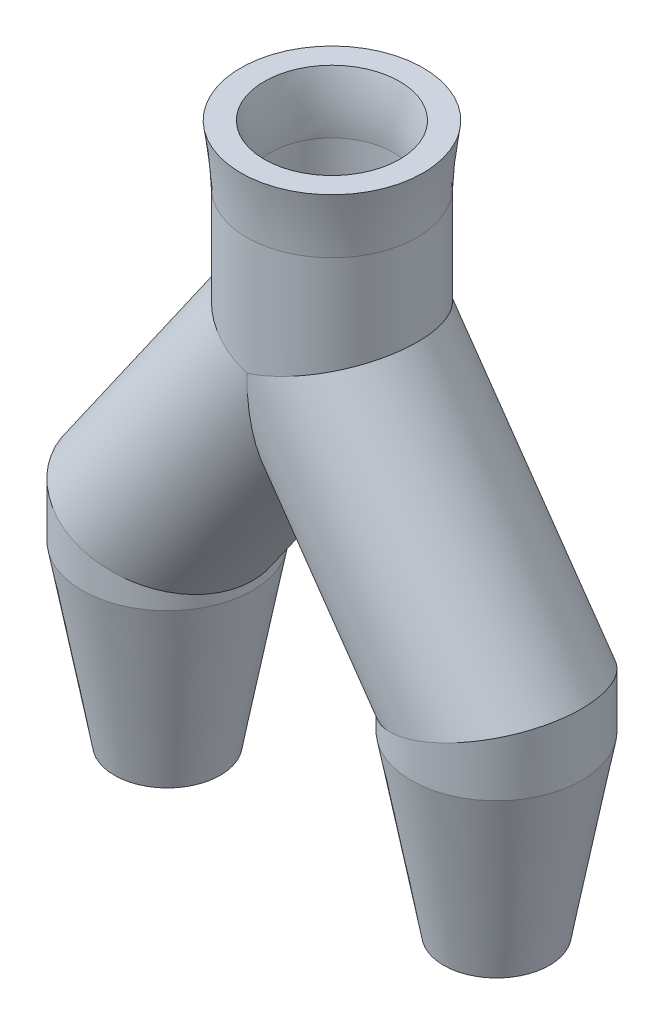
ISO-10303-21;
HEADER;
FILE_DESCRIPTION(('STEP AP214'),'2;1');
FILE_NAME('part.step','',(''),(''),'','','');
FILE_SCHEMA(('AUTOMOTIVE_DESIGN { 1 0 10303 214 1 1 1 1 }'));
ENDSEC;
DATA;
#1=APPLICATION_CONTEXT('core data for automotive mechanical design processes');
#2=APPLICATION_PROTOCOL_DEFINITION('international standard','automotive_design',2000,#1);
#3=PRODUCT_CONTEXT('',#1,'mechanical');
#4=PRODUCT('Part','Part','',(#3));
#5=PRODUCT_RELATED_PRODUCT_CATEGORY('part','',(#4));
#6=PRODUCT_DEFINITION_FORMATION('','',#4);
#7=PRODUCT_DEFINITION_CONTEXT('part definition',#1,'design');
#8=PRODUCT_DEFINITION('design','',#6,#7);
#9=PRODUCT_DEFINITION_SHAPE('','',#8);
#10=(LENGTH_UNIT() NAMED_UNIT(*) SI_UNIT(.MILLI.,.METRE.));
#11=(NAMED_UNIT(*) PLANE_ANGLE_UNIT() SI_UNIT($,.RADIAN.));
#12=(NAMED_UNIT(*) SI_UNIT($,.STERADIAN.) SOLID_ANGLE_UNIT());
#13=UNCERTAINTY_MEASURE_WITH_UNIT(LENGTH_MEASURE(1.E-05),#10,'distance_accuracy_value','');
#14=(GEOMETRIC_REPRESENTATION_CONTEXT(3) GLOBAL_UNCERTAINTY_ASSIGNED_CONTEXT((#13)) GLOBAL_UNIT_ASSIGNED_CONTEXT((#10,
#11,#12)) REPRESENTATION_CONTEXT('',''));
#15=CARTESIAN_POINT('',(0.,0.,0.));
#16=DIRECTION('',(0.,0.,1.));
#17=DIRECTION('',(1.,0.,0.));
#18=AXIS2_PLACEMENT_3D('',#15,#16,#17);
#19=CARTESIAN_POINT('',(14.,-23.,0.));
#20=DIRECTION('',(0.,1.,0.));
#21=DIRECTION('',(0.,0.,1.));
#22=AXIS2_PLACEMENT_3D('',#19,#20,#21);
#23=CYLINDRICAL_SURFACE('',#22,5.25);
#24=CARTESIAN_POINT('',(14.,-23.,0.));
#25=DIRECTION('',(0.,-1.,0.));
#26=DIRECTION('',(0.,0.,-1.));
#27=AXIS2_PLACEMENT_3D('',#24,#25,#26);
#28=CIRCLE('',#27,5.25);
#29=CARTESIAN_POINT('',(19.1666370588641,-23.,-0.931859164236744));
#30=VERTEX_POINT('',#29);
#31=EDGE_CURVE('E226',#30,#30,#28,.T.);
#32=ORIENTED_EDGE('',*,*,#31,.T.);
#33=EDGE_LOOP('',(#32));
#34=FACE_BOUND('',#33,.T.);
#35=CARTESIAN_POINT('',(14.,-20.,0.));
#36=DIRECTION('',(0.300639384879094,-0.953737888656795,0.));
#37=DIRECTION('',(-0.953737888656795,-0.300639384879094,0.));
#38=AXIS2_PLACEMENT_3D('',#35,#36,#37);
#39=ELLIPSE('',#38,5.50465705770994,5.25);
#40=CARTESIAN_POINT('',(8.75,-21.6549167118003,0.));
#41=VERTEX_POINT('',#40);
#42=EDGE_CURVE('E96',#41,#41,#39,.T.);
#43=ORIENTED_EDGE('',*,*,#42,.F.);
#44=EDGE_LOOP('',(#43));
#45=FACE_BOUND('',#44,.T.);
#46=ADVANCED_FACE('F58',(#34,#45),#23,.F.);
#47=CARTESIAN_POINT('',(14.,-23.,0.));
#48=DIRECTION('',(0.,1.,0.));
#49=DIRECTION('',(0.,0.,1.));
#50=AXIS2_PLACEMENT_3D('',#47,#48,#49);
#51=CYLINDRICAL_SURFACE('',#50,7.25);
#52=CARTESIAN_POINT('',(14.,-23.,0.));
#53=DIRECTION('',(0.,1.,0.));
#54=DIRECTION('',(0.,0.,1.));
#55=AXIS2_PLACEMENT_3D('',#52,#53,#54);
#56=CIRCLE('',#55,7.25);
#57=CARTESIAN_POINT('',(14.,-23.,7.25));
#58=VERTEX_POINT('',#57);
#59=EDGE_CURVE('E68',#58,#58,#56,.F.);
#60=ORIENTED_EDGE('',*,*,#59,.F.);
#61=EDGE_LOOP('',(#60));
#62=FACE_BOUND('',#61,.T.);
#63=CARTESIAN_POINT('',(14.,-20.,0.));
#64=DIRECTION('',(-0.300639384879094,0.953737888656795,0.));
#65=DIRECTION('',(0.953737888656795,0.300639384879094,0.));
#66=AXIS2_PLACEMENT_3D('',#63,#64,#65);
#67=ELLIPSE('',#66,7.60166927017087,7.25);
#68=CARTESIAN_POINT('',(21.25,-17.7146388265615,0.));
#69=VERTEX_POINT('',#68);
#70=EDGE_CURVE('E12',#69,#69,#67,.T.);
#71=ORIENTED_EDGE('',*,*,#70,.F.);
#72=EDGE_LOOP('',(#71));
#73=FACE_BOUND('',#72,.T.);
#74=ADVANCED_FACE('F60',(#62,#73),#51,.T.);
#75=CARTESIAN_POINT('',(14.,-20.,0.));
#76=DIRECTION('',(-0.573462344363328,0.81923192051904,0.));
#77=DIRECTION('',(-0.81923192051904,-0.573462344363328,0.));
#78=AXIS2_PLACEMENT_3D('',#75,#76,#77);
#79=CYLINDRICAL_SURFACE('',#78,5.25);
#80=ORIENTED_EDGE('',*,*,#42,.T.);
#81=EDGE_LOOP('',(#80));
#82=FACE_BOUND('',#81,.T.);
#83=CARTESIAN_POINT('',(0.,0.,0.));
#84=DIRECTION('',(1.,0.,0.));
#85=DIRECTION('',(0.,1.,0.));
#86=AXIS2_PLACEMENT_3D('',#83,#84,#85);
#87=ELLIPSE('',#86,9.15491671180027,5.25);
#88=CARTESIAN_POINT('',(0.,0.,5.25));
#89=VERTEX_POINT('',#88);
#90=CARTESIAN_POINT('',(0.,0.,-5.25));
#91=VERTEX_POINT('',#90);
#92=EDGE_CURVE('E82',#89,#91,#87,.T.);
#93=ORIENTED_EDGE('',*,*,#92,.F.);
#94=CARTESIAN_POINT('',(0.,0.,0.));
#95=DIRECTION('',(-0.300639384879094,0.953737888656795,0.));
#96=DIRECTION('',(-0.953737888656795,-0.300639384879094,0.));
#97=AXIS2_PLACEMENT_3D('',#94,#95,#96);
#98=ELLIPSE('',#97,5.50465705770994,5.25);
#99=EDGE_CURVE('E90',#89,#91,#98,.T.);
#100=ORIENTED_EDGE('',*,*,#99,.T.);
#101=EDGE_LOOP('',(#93,#100));
#102=FACE_BOUND('',#101,.T.);
#103=ADVANCED_FACE('F101',(#82,#102),#79,.F.);
#104=CARTESIAN_POINT('',(14.,-20.,0.));
#105=DIRECTION('',(-0.573462344363328,0.81923192051904,0.));
#106=DIRECTION('',(-0.81923192051904,-0.573462344363328,0.));
#107=AXIS2_PLACEMENT_3D('',#104,#105,#106);
#108=CYLINDRICAL_SURFACE('',#107,7.25);
#109=ORIENTED_EDGE('',*,*,#70,.T.);
#110=EDGE_LOOP('',(#109));
#111=FACE_BOUND('',#110,.T.);
#112=CARTESIAN_POINT('',(0.,0.,0.));
#113=DIRECTION('',(-0.300639384879094,0.953737888656795,0.));
#114=DIRECTION('',(-0.953737888656795,-0.300639384879094,0.));
#115=AXIS2_PLACEMENT_3D('',#112,#113,#114);
#116=ELLIPSE('',#115,7.60166927017087,7.25);
#117=CARTESIAN_POINT('',(0.,0.,7.25));
#118=VERTEX_POINT('',#117);
#119=CARTESIAN_POINT('',(0.,0.,-7.25));
#120=VERTEX_POINT('',#119);
#121=EDGE_CURVE('E75',#118,#120,#116,.T.);
#122=ORIENTED_EDGE('',*,*,#121,.F.);
#123=CARTESIAN_POINT('',(0.,0.,0.));
#124=DIRECTION('',(1.,0.,0.));
#125=DIRECTION('',(0.,1.,0.));
#126=AXIS2_PLACEMENT_3D('',#123,#124,#125);
#127=ELLIPSE('',#126,12.6425040305813,7.25);
#128=EDGE_CURVE('E95',#118,#120,#127,.T.);
#129=ORIENTED_EDGE('',*,*,#128,.T.);
#130=EDGE_LOOP('',(#122,#129));
#131=FACE_BOUND('',#130,.T.);
#132=ADVANCED_FACE('F150',(#111,#131),#108,.T.);
#133=CARTESIAN_POINT('',(0.,0.,0.));
#134=DIRECTION('',(0.,1.,0.));
#135=DIRECTION('',(0.,0.,1.));
#136=AXIS2_PLACEMENT_3D('',#133,#134,#135);
#137=CYLINDRICAL_SURFACE('',#136,5.25);
#138=ORIENTED_EDGE('',*,*,#99,.F.);
#139=CARTESIAN_POINT('',(0.,0.,0.));
#140=DIRECTION('',(0.300639384879094,0.953737888656794,0.));
#141=DIRECTION('',(-0.953737888656794,0.300639384879094,0.));
#142=AXIS2_PLACEMENT_3D('',#139,#140,#141);
#143=ELLIPSE('',#142,5.50465705770994,5.25);
#144=EDGE_CURVE('E93',#91,#89,#143,.T.);
#145=ORIENTED_EDGE('',*,*,#144,.F.);
#146=EDGE_LOOP('',(#138,#145));
#147=FACE_BOUND('',#146,.T.);
#148=CARTESIAN_POINT('',(0.,10.,0.));
#149=DIRECTION('',(0.,1.,0.));
#150=DIRECTION('',(0.,0.,1.));
#151=AXIS2_PLACEMENT_3D('',#148,#149,#150);
#152=CIRCLE('',#151,5.25);
#153=CARTESIAN_POINT('',(-2.73749013940013,10.,4.47980443062943));
#154=VERTEX_POINT('',#153);
#155=EDGE_CURVE('E62',#154,#154,#152,.T.);
#156=ORIENTED_EDGE('',*,*,#155,.T.);
#157=EDGE_LOOP('',(#156));
#158=FACE_BOUND('',#157,.T.);
#159=ADVANCED_FACE('F91',(#147,#158),#137,.F.);
#160=CARTESIAN_POINT('',(0.,0.,0.));
#161=DIRECTION('',(0.,1.,0.));
#162=DIRECTION('',(0.,0.,1.));
#163=AXIS2_PLACEMENT_3D('',#160,#161,#162);
#164=CYLINDRICAL_SURFACE('',#163,7.25);
#165=CARTESIAN_POINT('',(0.,0.,0.));
#166=DIRECTION('',(0.300639384879094,0.953737888656794,0.));
#167=DIRECTION('',(-0.953737888656794,0.300639384879094,0.));
#168=AXIS2_PLACEMENT_3D('',#165,#166,#167);
#169=ELLIPSE('',#168,7.60166927017087,7.25);
#170=EDGE_CURVE('E99',#120,#118,#169,.T.);
#171=ORIENTED_EDGE('',*,*,#170,.T.);
#172=ORIENTED_EDGE('',*,*,#121,.T.);
#173=EDGE_LOOP('',(#171,#172));
#174=FACE_BOUND('',#173,.T.);
#175=CARTESIAN_POINT('',(0.,10.,0.));
#176=DIRECTION('',(0.,1.,0.));
#177=DIRECTION('',(0.,0.,1.));
#178=AXIS2_PLACEMENT_3D('',#175,#176,#177);
#179=CIRCLE('',#178,7.25);
#180=CARTESIAN_POINT('',(-6.04203803526265,10.,4.0070283728019));
#181=VERTEX_POINT('',#180);
#182=EDGE_CURVE('E323',#181,#181,#179,.T.);
#183=ORIENTED_EDGE('',*,*,#182,.F.);
#184=EDGE_LOOP('',(#183));
#185=FACE_BOUND('',#184,.T.);
#186=ADVANCED_FACE('F142',(#174,#185),#164,.T.);
#187=CARTESIAN_POINT('',(-14.,-20.,0.));
#188=DIRECTION('',(0.573462344363328,0.819231920519041,0.));
#189=DIRECTION('',(-0.819231920519041,0.573462344363328,0.));
#190=AXIS2_PLACEMENT_3D('',#187,#188,#189);
#191=CYLINDRICAL_SURFACE('',#190,5.25);
#192=CARTESIAN_POINT('',(-14.,-20.,0.));
#193=DIRECTION('',(0.300639384879094,0.953737888656794,0.));
#194=DIRECTION('',(-0.953737888656794,0.300639384879094,0.));
#195=AXIS2_PLACEMENT_3D('',#192,#193,#194);
#196=ELLIPSE('',#195,5.50465705770994,5.25);
#197=CARTESIAN_POINT('',(-19.25,-18.3450832881997,0.));
#198=VERTEX_POINT('',#197);
#199=EDGE_CURVE('E268',#198,#198,#196,.T.);
#200=ORIENTED_EDGE('',*,*,#199,.F.);
#201=EDGE_LOOP('',(#200));
#202=FACE_BOUND('',#201,.T.);
#203=ORIENTED_EDGE('',*,*,#92,.T.);
#204=ORIENTED_EDGE('',*,*,#144,.T.);
#205=EDGE_LOOP('',(#203,#204));
#206=FACE_BOUND('',#205,.T.);
#207=ADVANCED_FACE('F98',(#202,#206),#191,.F.);
#208=CARTESIAN_POINT('',(-14.,-20.,0.));
#209=DIRECTION('',(0.573462344363328,0.819231920519041,0.));
#210=DIRECTION('',(-0.819231920519041,0.573462344363328,0.));
#211=AXIS2_PLACEMENT_3D('',#208,#209,#210);
#212=CYLINDRICAL_SURFACE('',#211,7.25);
#213=CARTESIAN_POINT('',(-14.,-20.,0.));
#214=DIRECTION('',(-0.300639384879094,-0.953737888656794,0.));
#215=DIRECTION('',(0.953737888656794,-0.300639384879094,0.));
#216=AXIS2_PLACEMENT_3D('',#213,#214,#215);
#217=ELLIPSE('',#216,7.60166927017087,7.25);
#218=CARTESIAN_POINT('',(-6.74999999999999,-22.2853611734385,0.));
#219=VERTEX_POINT('',#218);
#220=EDGE_CURVE('E273',#219,#219,#217,.T.);
#221=ORIENTED_EDGE('',*,*,#220,.F.);
#222=EDGE_LOOP('',(#221));
#223=FACE_BOUND('',#222,.T.);
#224=ORIENTED_EDGE('',*,*,#170,.F.);
#225=ORIENTED_EDGE('',*,*,#128,.F.);
#226=EDGE_LOOP('',(#224,#225));
#227=FACE_BOUND('',#226,.T.);
#228=ADVANCED_FACE('F136',(#223,#227),#212,.T.);
#229=CARTESIAN_POINT('',(-14.,-23.,0.));
#230=DIRECTION('',(0.,1.,0.));
#231=DIRECTION('',(-1.,0.,0.));
#232=AXIS2_PLACEMENT_3D('',#229,#230,#231);
#233=CYLINDRICAL_SURFACE('',#232,5.25);
#234=CARTESIAN_POINT('',(-14.,-23.,0.));
#235=DIRECTION('',(0.,1.,0.));
#236=DIRECTION('',(0.,0.,-1.));
#237=AXIS2_PLACEMENT_3D('',#234,#235,#236);
#238=CIRCLE('',#237,5.25);
#239=CARTESIAN_POINT('',(-19.1666370588641,-23.,-0.931859164236744));
#240=VERTEX_POINT('',#239);
#241=EDGE_CURVE('E163',#240,#240,#238,.T.);
#242=ORIENTED_EDGE('',*,*,#241,.F.);
#243=EDGE_LOOP('',(#242));
#244=FACE_BOUND('',#243,.T.);
#245=ORIENTED_EDGE('',*,*,#199,.T.);
#246=EDGE_LOOP('',(#245));
#247=FACE_BOUND('',#246,.T.);
#248=ADVANCED_FACE('F133',(#244,#247),#233,.F.);
#249=CARTESIAN_POINT('',(-14.,-23.,0.));
#250=DIRECTION('',(0.,1.,0.));
#251=DIRECTION('',(-1.,0.,0.));
#252=AXIS2_PLACEMENT_3D('',#249,#250,#251);
#253=CYLINDRICAL_SURFACE('',#252,7.25);
#254=CARTESIAN_POINT('',(-14.,-23.,0.));
#255=DIRECTION('',(0.,-1.,0.));
#256=DIRECTION('',(0.,0.,-1.));
#257=AXIS2_PLACEMENT_3D('',#254,#255,#256);
#258=CIRCLE('',#257,7.25);
#259=CARTESIAN_POINT('',(-14.,-23.,-7.25));
#260=VERTEX_POINT('',#259);
#261=EDGE_CURVE('E115',#260,#260,#258,.T.);
#262=ORIENTED_EDGE('',*,*,#261,.F.);
#263=EDGE_LOOP('',(#262));
#264=FACE_BOUND('',#263,.T.);
#265=ORIENTED_EDGE('',*,*,#220,.T.);
#266=EDGE_LOOP('',(#265));
#267=FACE_BOUND('',#266,.T.);
#268=ADVANCED_FACE('F122',(#264,#267),#253,.T.);
#269=CARTESIAN_POINT('',(14.,-38.,0.));
#270=DIRECTION('',(0.,1.,0.));
#271=DIRECTION('',(0.,0.,1.));
#272=AXIS2_PLACEMENT_3D('',#269,#270,#271);
#273=PLANE('',#272);
#274=CARTESIAN_POINT('',(14.,-38.,0.));
#275=DIRECTION('',(0.,1.,0.));
#276=DIRECTION('',(0.,0.,1.));
#277=AXIS2_PLACEMENT_3D('',#274,#275,#276);
#278=CIRCLE('',#277,2.5);
#279=CARTESIAN_POINT('',(16.4974149483021,-38.,0.113659913766334));
#280=VERTEX_POINT('',#279);
#281=EDGE_CURVE('E231',#280,#280,#278,.T.);
#282=ORIENTED_EDGE('',*,*,#281,.T.);
#283=EDGE_LOOP('',(#282));
#284=FACE_BOUND('',#283,.T.);
#285=CARTESIAN_POINT('',(14.,-38.,0.));
#286=DIRECTION('',(0.,1.,0.));
#287=DIRECTION('',(0.,0.,1.));
#288=AXIS2_PLACEMENT_3D('',#285,#286,#287);
#289=CIRCLE('',#288,4.5);
#290=CARTESIAN_POINT('',(14.,-38.,4.5));
#291=VERTEX_POINT('',#290);
#292=EDGE_CURVE('E234',#291,#291,#289,.T.);
#293=ORIENTED_EDGE('',*,*,#292,.F.);
#294=EDGE_LOOP('',(#293));
#295=FACE_BOUND('',#294,.T.);
#296=ADVANCED_FACE('F132',(#284,#295),#273,.F.);
#297=CARTESIAN_POINT('',(14.,-38.,0.));
#298=DIRECTION('',(0.,1.,0.));
#299=DIRECTION('',(0.,0.,1.));
#300=AXIS2_PLACEMENT_3D('',#297,#298,#299);
#301=CONICAL_SURFACE('',#300,4.5,0.18131977440149);
#302=ORIENTED_EDGE('',*,*,#59,.T.);
#303=EDGE_LOOP('',(#302));
#304=FACE_BOUND('',#303,.T.);
#305=ORIENTED_EDGE('',*,*,#292,.T.);
#306=EDGE_LOOP('',(#305));
#307=FACE_BOUND('',#306,.T.);
#308=ADVANCED_FACE('F244',(#304,#307),#301,.T.);
#309=CARTESIAN_POINT('',(19.1666370588641,-23.,-0.931859164236744));
#310=CARTESIAN_POINT('',(16.4974149483021,-38.,0.113659913766334));
#311=CARTESIAN_POINT('',(21.0303553873376,-23.,9.40141495349148));
#312=CARTESIAN_POINT('',(16.2700951207694,-38.,5.10848981037047));
#313=CARTESIAN_POINT('',(10.6970812696094,-23.,11.265133281965));
#314=CARTESIAN_POINT('',(11.2752652241653,-38.,4.8811699828378));
#315=CARTESIAN_POINT('',(8.83336294113589,-23.,0.931859164236745));
#316=CARTESIAN_POINT('',(11.5025850516979,-38.,-0.113659913766334));
#317=CARTESIAN_POINT('',(6.9696446126624,-23.,-9.40141495349148));
#318=CARTESIAN_POINT('',(11.7299048792306,-38.,-5.10848981037047));
#319=CARTESIAN_POINT('',(17.3029187303906,-23.,-11.265133281965));
#320=CARTESIAN_POINT('',(16.7247347758347,-38.,-4.8811699828378));
#321=CARTESIAN_POINT('',(19.1666370588641,-23.,-0.931859164236744));
#322=CARTESIAN_POINT('',(16.4974149483021,-38.,0.113659913766334));
#323=(BOUNDED_SURFACE() B_SPLINE_SURFACE(3,1,((#309,#310),(#311,#312),(#313,#314),(#315,#316),
(#317,#318),(#319,#320),(#321,#322)),.UNSPECIFIED.,.T.,.F.,.F.) B_SPLINE_SURFACE_WITH_KNOTS((4,
3,4),(2,2),(0.,0.5,1.),(0.,1.),
.UNSPECIFIED.) GEOMETRIC_REPRESENTATION_ITEM() RATIONAL_B_SPLINE_SURFACE(((1.,1.),
(0.333333333333333,0.333333333333333),(0.333333333333333,0.333333333333333),(1.,1.),
(0.333333333333333,0.333333333333333),(0.333333333333333,0.333333333333333),(1.,1.))) REPRESENTATION_ITEM('') SURFACE());
#324=CARTESIAN_POINT('',(19.1666370588641,-23.,-0.931859164236744));
#325=CARTESIAN_POINT('',(19.1388326618791,-23.15625,-0.920968340507546));
#326=CARTESIAN_POINT('',(19.1110282648941,-23.3125,-0.910077516778347));
#327=CARTESIAN_POINT('',(19.055419470924,-23.625,-0.888295869319949));
#328=CARTESIAN_POINT('',(19.027615073939,-23.78125,-0.87740504559075));
#329=CARTESIAN_POINT('',(18.972006279969,-24.09375,-0.855623398132353));
#330=CARTESIAN_POINT('',(18.9442018829839,-24.25,-0.844732574403154));
#331=CARTESIAN_POINT('',(18.8885930890139,-24.5625,-0.822950926944757));
#332=CARTESIAN_POINT('',(18.8607886920289,-24.71875,-0.812060103215558));
#333=CARTESIAN_POINT('',(18.8051798980588,-25.03125,-0.790278455757161));
#334=CARTESIAN_POINT('',(18.7773755010738,-25.1875,-0.779387632027962));
#335=CARTESIAN_POINT('',(18.7217667071038,-25.5,-0.757605984569565));
#336=CARTESIAN_POINT('',(18.6939623101188,-25.65625,-0.746715160840366));
#337=CARTESIAN_POINT('',(18.6383535161487,-25.96875,-0.724933513381968));
#338=CARTESIAN_POINT('',(18.6105491191637,-26.125,-0.71404268965277));
#339=CARTESIAN_POINT('',(18.5549403251936,-26.4375,-0.692261042194372));
#340=CARTESIAN_POINT('',(18.5271359282086,-26.59375,-0.681370218465173));
#341=CARTESIAN_POINT('',(18.4715271342386,-26.90625,-0.659588571006776));
#342=CARTESIAN_POINT('',(18.4437227372536,-27.0625,-0.648697747277577));
#343=CARTESIAN_POINT('',(18.3881139432835,-27.375,-0.62691609981918));
#344=CARTESIAN_POINT('',(18.3603095462985,-27.53125,-0.616025276089981));
#345=CARTESIAN_POINT('',(18.3047007523285,-27.84375,-0.594243628631584));
#346=CARTESIAN_POINT('',(18.2768963553434,-28.,-0.583352804902385));
#347=CARTESIAN_POINT('',(18.2212875613734,-28.3125,-0.561571157443987));
#348=CARTESIAN_POINT('',(18.1934831643884,-28.46875,-0.550680333714789));
#349=CARTESIAN_POINT('',(18.1378743704183,-28.78125,-0.528898686256391));
#350=CARTESIAN_POINT('',(18.1100699734333,-28.9375,-0.518007862527193));
#351=CARTESIAN_POINT('',(18.0544611794633,-29.25,-0.496226215068795));
#352=CARTESIAN_POINT('',(18.0266567824782,-29.40625,-0.485335391339596));
#353=CARTESIAN_POINT('',(17.9710479885082,-29.71875,-0.463553743881199));
#354=CARTESIAN_POINT('',(17.9432435915232,-29.875,-0.452662920152));
#355=CARTESIAN_POINT('',(17.8876347975531,-30.1875,-0.430881272693603));
#356=CARTESIAN_POINT('',(17.8598304005681,-30.34375,-0.419990448964404));
#357=CARTESIAN_POINT('',(17.8042216065981,-30.65625,-0.398208801506006));
#358=CARTESIAN_POINT('',(17.7764172096131,-30.8125,-0.387317977776808));
#359=CARTESIAN_POINT('',(17.720808415643,-31.125,-0.36553633031841));
#360=CARTESIAN_POINT('',(17.693004018658,-31.28125,-0.354645506589212));
#361=CARTESIAN_POINT('',(17.6373952246879,-31.59375,-0.332863859130814));
#362=CARTESIAN_POINT('',(17.6095908277029,-31.75,-0.321973035401615));
#363=CARTESIAN_POINT('',(17.5539820337329,-32.0625,-0.300191387943218));
#364=CARTESIAN_POINT('',(17.5261776367479,-32.21875,-0.289300564214019));
#365=CARTESIAN_POINT('',(17.4705688427778,-32.53125,-0.267518916755622));
#366=CARTESIAN_POINT('',(17.4427644457928,-32.6875,-0.256628093026423));
#367=CARTESIAN_POINT('',(17.3871556518228,-33.,-0.234846445568026));
#368=CARTESIAN_POINT('',(17.3593512548377,-33.15625,-0.223955621838827));
#369=CARTESIAN_POINT('',(17.3037424608677,-33.46875,-0.202173974380429));
#370=CARTESIAN_POINT('',(17.2759380638827,-33.625,-0.191283150651231));
#371=CARTESIAN_POINT('',(17.2203292699126,-33.9375,-0.169501503192833));
#372=CARTESIAN_POINT('',(17.1925248729276,-34.09375,-0.158610679463635));
#373=CARTESIAN_POINT('',(17.1369160789576,-34.40625,-0.136829032005237));
#374=CARTESIAN_POINT('',(17.1091116819725,-34.5625,-0.125938208276038));
#375=CARTESIAN_POINT('',(17.0535028880025,-34.875,-0.104156560817641));
#376=CARTESIAN_POINT('',(17.0256984910175,-35.03125,-0.093265737088442));
#377=CARTESIAN_POINT('',(16.9700896970474,-35.34375,-0.0714840896300446));
#378=CARTESIAN_POINT('',(16.9422853000624,-35.5,-0.0605932659008459));
#379=CARTESIAN_POINT('',(16.8866765060924,-35.8125,-0.0388116184424485));
#380=CARTESIAN_POINT('',(16.8588721091073,-35.96875,-0.0279207947132499));
#381=CARTESIAN_POINT('',(16.8032633151373,-36.28125,-0.00613914725485239));
#382=CARTESIAN_POINT('',(16.7754589181523,-36.4375,0.00475167647434641));
#383=CARTESIAN_POINT('',(16.7198501241822,-36.75,0.0265333239327439));
#384=CARTESIAN_POINT('',(16.6920457271972,-36.90625,0.0374241476619426));
#385=CARTESIAN_POINT('',(16.6364369332272,-37.21875,0.0592057951203401));
#386=CARTESIAN_POINT('',(16.6086325362422,-37.375,0.0700966188495388));
#387=CARTESIAN_POINT('',(16.5530237422721,-37.6875,0.0918782663079364));
#388=CARTESIAN_POINT('',(16.5252193452871,-37.84375,0.102769090037135));
#389=CARTESIAN_POINT('',(16.4974149483021,-38.,0.113659913766334));
#390=B_SPLINE_CURVE_WITH_KNOTS('',3,(#324,#325,#326,#327,#328,#329,#330,#331,#332,#333,#334,
#335,#336,#337,#338,#339,#340,#341,#342,#343,#344,#345,#346,#347,#348,#349,#350,#351,#352,#353,
#354,#355,#356,#357,#358,#359,#360,#361,#362,#363,#364,#365,#366,#367,#368,#369,#370,#371,#372,
#373,#374,#375,#376,#377,#378,#379,#380,#381,#382,#383,#384,#385,#386,#387,#388,#389),
.UNSPECIFIED.,.F.,.F.,(4,2,2,2,2,2,2,2,2,2,2,2,2,2,2,2,2,2,2,2,2,2,2,2,2,2,2,2,2,2,2,2,4),(0.,
0.477233499765902,0.954466999531799,1.4317004992977,1.9089339990636,2.3861674988295,
2.86340099859541,3.34063449836131,3.81786799812721,4.29510149789311,4.77233499765901,
5.24956849742491,5.72680199719081,6.20403549695671,6.68126899672261,7.15850249648852,
7.63573599625441,8.11296949602032,8.59020299578622,9.06743649555212,9.54466999531802,
10.0219034950839,10.4991369948498,10.9763704946157,11.4536039943816,11.9308374941475,
12.4080709939134,12.8853044936793,13.3625379934452,13.8397714932111,14.317004992977,
14.7942384927429,15.2714719925088),.UNSPECIFIED.);
#391=EDGE_CURVE('BSEAM252',#30,#280,#390,.T.);
#392=ORIENTED_EDGE('',*,*,#31,.F.);
#393=ORIENTED_EDGE('',*,*,#281,.F.);
#394=ORIENTED_EDGE('',*,*,#391,.T.);
#395=ORIENTED_EDGE('',*,*,#391,.F.);
#396=EDGE_LOOP('',(#392,#394,#393,#395));
#397=FACE_BOUND('',#396,.T.);
#398=ADVANCED_FACE('F252',(#397),#323,.F.);
#399=CARTESIAN_POINT('',(-14.,-38.,0.));
#400=DIRECTION('',(0.,1.,0.));
#401=DIRECTION('',(0.,0.,1.));
#402=AXIS2_PLACEMENT_3D('',#399,#400,#401);
#403=PLANE('',#402);
#404=CARTESIAN_POINT('',(-14.,-38.,0.));
#405=DIRECTION('',(0.,-1.,0.));
#406=DIRECTION('',(0.,0.,1.));
#407=AXIS2_PLACEMENT_3D('',#404,#405,#406);
#408=CIRCLE('',#407,2.5);
#409=CARTESIAN_POINT('',(-16.4974149483021,-38.,0.113659913766334));
#410=VERTEX_POINT('',#409);
#411=EDGE_CURVE('E166',#410,#410,#408,.T.);
#412=ORIENTED_EDGE('',*,*,#411,.F.);
#413=EDGE_LOOP('',(#412));
#414=FACE_BOUND('',#413,.T.);
#415=CARTESIAN_POINT('',(-14.,-38.,0.));
#416=DIRECTION('',(0.,-1.,0.));
#417=DIRECTION('',(0.,0.,1.));
#418=AXIS2_PLACEMENT_3D('',#415,#416,#417);
#419=CIRCLE('',#418,4.5);
#420=CARTESIAN_POINT('',(-14.,-38.,4.5));
#421=VERTEX_POINT('',#420);
#422=EDGE_CURVE('E179',#421,#421,#419,.T.);
#423=ORIENTED_EDGE('',*,*,#422,.T.);
#424=EDGE_LOOP('',(#423));
#425=FACE_BOUND('',#424,.T.);
#426=ADVANCED_FACE('F198',(#414,#425),#403,.F.);
#427=CARTESIAN_POINT('',(-14.,-38.,0.));
#428=DIRECTION('',(0.,1.,0.));
#429=DIRECTION('',(0.,0.,1.));
#430=AXIS2_PLACEMENT_3D('',#427,#428,#429);
#431=CONICAL_SURFACE('',#430,4.5,0.18131977440149);
#432=ORIENTED_EDGE('',*,*,#261,.T.);
#433=EDGE_LOOP('',(#432));
#434=FACE_BOUND('',#433,.T.);
#435=ORIENTED_EDGE('',*,*,#422,.F.);
#436=EDGE_LOOP('',(#435));
#437=FACE_BOUND('',#436,.T.);
#438=ADVANCED_FACE('F188',(#434,#437),#431,.T.);
#439=CARTESIAN_POINT('',(-19.1666370588641,-23.,-0.931859164236744));
#440=CARTESIAN_POINT('',(-16.4974149483021,-38.,0.113659913766334));
#441=CARTESIAN_POINT('',(-21.0303553873376,-23.,9.40141495349148));
#442=CARTESIAN_POINT('',(-16.2700951207694,-38.,5.10848981037047));
#443=CARTESIAN_POINT('',(-10.6970812696094,-23.,11.265133281965));
#444=CARTESIAN_POINT('',(-11.2752652241653,-38.,4.8811699828378));
#445=CARTESIAN_POINT('',(-8.83336294113589,-23.,0.931859164236745));
#446=CARTESIAN_POINT('',(-11.5025850516979,-38.,-0.113659913766334));
#447=CARTESIAN_POINT('',(-6.9696446126624,-23.,-9.40141495349148));
#448=CARTESIAN_POINT('',(-11.7299048792306,-38.,-5.10848981037047));
#449=CARTESIAN_POINT('',(-17.3029187303906,-23.,-11.265133281965));
#450=CARTESIAN_POINT('',(-16.7247347758347,-38.,-4.8811699828378));
#451=CARTESIAN_POINT('',(-19.1666370588641,-23.,-0.931859164236744));
#452=CARTESIAN_POINT('',(-16.4974149483021,-38.,0.113659913766334));
#453=(BOUNDED_SURFACE() B_SPLINE_SURFACE(3,1,((#439,#440),(#441,#442),(#443,#444),(#445,#446),
(#447,#448),(#449,#450),(#451,#452)),.UNSPECIFIED.,.T.,.F.,.F.) B_SPLINE_SURFACE_WITH_KNOTS((4,
3,4),(2,2),(0.,0.5,1.),(0.,1.),
.UNSPECIFIED.) GEOMETRIC_REPRESENTATION_ITEM() RATIONAL_B_SPLINE_SURFACE(((1.,1.),
(0.333333333333333,0.333333333333333),(0.333333333333333,0.333333333333333),(1.,1.),
(0.333333333333333,0.333333333333333),(0.333333333333333,0.333333333333333),(1.,1.))) REPRESENTATION_ITEM('') SURFACE());
#454=CARTESIAN_POINT('',(-19.1666370588641,-23.,-0.931859164236744));
#455=CARTESIAN_POINT('',(-19.1388326618791,-23.15625,-0.920968340507546));
#456=CARTESIAN_POINT('',(-19.1110282648941,-23.3125,-0.910077516778347));
#457=CARTESIAN_POINT('',(-19.055419470924,-23.625,-0.888295869319949));
#458=CARTESIAN_POINT('',(-19.027615073939,-23.78125,-0.87740504559075));
#459=CARTESIAN_POINT('',(-18.972006279969,-24.09375,-0.855623398132353));
#460=CARTESIAN_POINT('',(-18.9442018829839,-24.25,-0.844732574403154));
#461=CARTESIAN_POINT('',(-18.8885930890139,-24.5625,-0.822950926944757));
#462=CARTESIAN_POINT('',(-18.8607886920289,-24.71875,-0.812060103215558));
#463=CARTESIAN_POINT('',(-18.8051798980588,-25.03125,-0.790278455757161));
#464=CARTESIAN_POINT('',(-18.7773755010738,-25.1875,-0.779387632027962));
#465=CARTESIAN_POINT('',(-18.7217667071038,-25.5,-0.757605984569565));
#466=CARTESIAN_POINT('',(-18.6939623101188,-25.65625,-0.746715160840366));
#467=CARTESIAN_POINT('',(-18.6383535161487,-25.96875,-0.724933513381968));
#468=CARTESIAN_POINT('',(-18.6105491191637,-26.125,-0.71404268965277));
#469=CARTESIAN_POINT('',(-18.5549403251936,-26.4375,-0.692261042194372));
#470=CARTESIAN_POINT('',(-18.5271359282086,-26.59375,-0.681370218465173));
#471=CARTESIAN_POINT('',(-18.4715271342386,-26.90625,-0.659588571006776));
#472=CARTESIAN_POINT('',(-18.4437227372536,-27.0625,-0.648697747277577));
#473=CARTESIAN_POINT('',(-18.3881139432835,-27.375,-0.62691609981918));
#474=CARTESIAN_POINT('',(-18.3603095462985,-27.53125,-0.616025276089981));
#475=CARTESIAN_POINT('',(-18.3047007523285,-27.84375,-0.594243628631584));
#476=CARTESIAN_POINT('',(-18.2768963553434,-28.,-0.583352804902385));
#477=CARTESIAN_POINT('',(-18.2212875613734,-28.3125,-0.561571157443987));
#478=CARTESIAN_POINT('',(-18.1934831643884,-28.46875,-0.550680333714789));
#479=CARTESIAN_POINT('',(-18.1378743704183,-28.78125,-0.528898686256391));
#480=CARTESIAN_POINT('',(-18.1100699734333,-28.9375,-0.518007862527193));
#481=CARTESIAN_POINT('',(-18.0544611794633,-29.25,-0.496226215068795));
#482=CARTESIAN_POINT('',(-18.0266567824782,-29.40625,-0.485335391339596));
#483=CARTESIAN_POINT('',(-17.9710479885082,-29.71875,-0.463553743881199));
#484=CARTESIAN_POINT('',(-17.9432435915232,-29.875,-0.452662920152));
#485=CARTESIAN_POINT('',(-17.8876347975531,-30.1875,-0.430881272693603));
#486=CARTESIAN_POINT('',(-17.8598304005681,-30.34375,-0.419990448964404));
#487=CARTESIAN_POINT('',(-17.8042216065981,-30.65625,-0.398208801506006));
#488=CARTESIAN_POINT('',(-17.7764172096131,-30.8125,-0.387317977776808));
#489=CARTESIAN_POINT('',(-17.720808415643,-31.125,-0.36553633031841));
#490=CARTESIAN_POINT('',(-17.693004018658,-31.28125,-0.354645506589212));
#491=CARTESIAN_POINT('',(-17.6373952246879,-31.59375,-0.332863859130814));
#492=CARTESIAN_POINT('',(-17.6095908277029,-31.75,-0.321973035401615));
#493=CARTESIAN_POINT('',(-17.5539820337329,-32.0625,-0.300191387943218));
#494=CARTESIAN_POINT('',(-17.5261776367479,-32.21875,-0.289300564214019));
#495=CARTESIAN_POINT('',(-17.4705688427778,-32.53125,-0.267518916755622));
#496=CARTESIAN_POINT('',(-17.4427644457928,-32.6875,-0.256628093026423));
#497=CARTESIAN_POINT('',(-17.3871556518228,-33.,-0.234846445568026));
#498=CARTESIAN_POINT('',(-17.3593512548377,-33.15625,-0.223955621838827));
#499=CARTESIAN_POINT('',(-17.3037424608677,-33.46875,-0.202173974380429));
#500=CARTESIAN_POINT('',(-17.2759380638827,-33.625,-0.191283150651231));
#501=CARTESIAN_POINT('',(-17.2203292699126,-33.9375,-0.169501503192833));
#502=CARTESIAN_POINT('',(-17.1925248729276,-34.09375,-0.158610679463635));
#503=CARTESIAN_POINT('',(-17.1369160789576,-34.40625,-0.136829032005237));
#504=CARTESIAN_POINT('',(-17.1091116819725,-34.5625,-0.125938208276038));
#505=CARTESIAN_POINT('',(-17.0535028880025,-34.875,-0.104156560817641));
#506=CARTESIAN_POINT('',(-17.0256984910175,-35.03125,-0.093265737088442));
#507=CARTESIAN_POINT('',(-16.9700896970474,-35.34375,-0.0714840896300446));
#508=CARTESIAN_POINT('',(-16.9422853000624,-35.5,-0.0605932659008459));
#509=CARTESIAN_POINT('',(-16.8866765060924,-35.8125,-0.0388116184424485));
#510=CARTESIAN_POINT('',(-16.8588721091073,-35.96875,-0.0279207947132499));
#511=CARTESIAN_POINT('',(-16.8032633151373,-36.28125,-0.00613914725485239));
#512=CARTESIAN_POINT('',(-16.7754589181523,-36.4375,0.00475167647434641));
#513=CARTESIAN_POINT('',(-16.7198501241822,-36.75,0.0265333239327439));
#514=CARTESIAN_POINT('',(-16.6920457271972,-36.90625,0.0374241476619426));
#515=CARTESIAN_POINT('',(-16.6364369332272,-37.21875,0.0592057951203401));
#516=CARTESIAN_POINT('',(-16.6086325362422,-37.375,0.0700966188495388));
#517=CARTESIAN_POINT('',(-16.5530237422721,-37.6875,0.0918782663079364));
#518=CARTESIAN_POINT('',(-16.5252193452871,-37.84375,0.102769090037135));
#519=CARTESIAN_POINT('',(-16.4974149483021,-38.,0.113659913766334));
#520=B_SPLINE_CURVE_WITH_KNOTS('',3,(#454,#455,#456,#457,#458,#459,#460,#461,#462,#463,#464,
#465,#466,#467,#468,#469,#470,#471,#472,#473,#474,#475,#476,#477,#478,#479,#480,#481,#482,#483,
#484,#485,#486,#487,#488,#489,#490,#491,#492,#493,#494,#495,#496,#497,#498,#499,#500,#501,#502,
#503,#504,#505,#506,#507,#508,#509,#510,#511,#512,#513,#514,#515,#516,#517,#518,#519),
.UNSPECIFIED.,.F.,.F.,(4,2,2,2,2,2,2,2,2,2,2,2,2,2,2,2,2,2,2,2,2,2,2,2,2,2,2,2,2,2,2,2,4),(0.,
0.477233499765902,0.954466999531799,1.4317004992977,1.9089339990636,2.3861674988295,
2.86340099859541,3.34063449836131,3.81786799812721,4.29510149789311,4.77233499765901,
5.24956849742491,5.72680199719081,6.20403549695671,6.68126899672261,7.15850249648852,
7.63573599625441,8.11296949602032,8.59020299578622,9.06743649555212,9.54466999531802,
10.0219034950839,10.4991369948498,10.9763704946157,11.4536039943816,11.9308374941475,
12.4080709939134,12.8853044936793,13.3625379934452,13.8397714932111,14.317004992977,
14.7942384927429,15.2714719925088),.UNSPECIFIED.);
#521=EDGE_CURVE('BSEAM197',#240,#410,#520,.T.);
#522=ORIENTED_EDGE('',*,*,#241,.T.);
#523=ORIENTED_EDGE('',*,*,#411,.T.);
#524=ORIENTED_EDGE('',*,*,#521,.T.);
#525=ORIENTED_EDGE('',*,*,#521,.F.);
#526=EDGE_LOOP('',(#522,#524,#523,#525));
#527=FACE_BOUND('',#526,.T.);
#528=ADVANCED_FACE('F197',(#527),#453,.T.);
#529=CARTESIAN_POINT('',(0.,15.,0.));
#530=DIRECTION('',(0.,1.,0.));
#531=DIRECTION('',(0.,0.,1.));
#532=AXIS2_PLACEMENT_3D('',#529,#530,#531);
#533=PLANE('',#532);
#534=CARTESIAN_POINT('',(0.,15.,0.));
#535=DIRECTION('',(0.,1.,0.));
#536=DIRECTION('',(0.,0.,1.));
#537=AXIS2_PLACEMENT_3D('',#534,#535,#536);
#538=CIRCLE('',#537,5.75);
#539=CARTESIAN_POINT('',(-5.19658605100707,15.,2.46129913145046));
#540=VERTEX_POINT('',#539);
#541=EDGE_CURVE('E362',#540,#540,#538,.T.);
#542=ORIENTED_EDGE('',*,*,#541,.F.);
#543=EDGE_LOOP('',(#542));
#544=FACE_BOUND('',#543,.T.);
#545=CARTESIAN_POINT('',(0.,15.,0.));
#546=DIRECTION('',(0.,1.,0.));
#547=DIRECTION('',(0.,0.,1.));
#548=AXIS2_PLACEMENT_3D('',#545,#546,#547);
#549=CIRCLE('',#548,7.75);
#550=CARTESIAN_POINT('',(-7.37966409433592,15.,2.36707791480746));
#551=VERTEX_POINT('',#550);
#552=EDGE_CURVE('E167',#551,#551,#549,.T.);
#553=ORIENTED_EDGE('',*,*,#552,.T.);
#554=EDGE_LOOP('',(#553));
#555=FACE_BOUND('',#554,.T.);
#556=ADVANCED_FACE('F310',(#544,#555),#533,.T.);
#557=CARTESIAN_POINT('',(-6.04203803526265,10.,4.0070283728019));
#558=CARTESIAN_POINT('',(-7.37966409433592,15.,2.36707791480746));
#559=CARTESIAN_POINT('',(1.97201871034115,10.,16.0911044433272));
#560=CARTESIAN_POINT('',(-2.645508264721,15.,17.1264061034793));
#561=CARTESIAN_POINT('',(14.0560947808664,10.,8.07704769772339));
#562=CARTESIAN_POINT('',(12.1138199239509,15.,12.3922502738644));
#563=CARTESIAN_POINT('',(6.04203803526265,10.,-4.0070283728019));
#564=CARTESIAN_POINT('',(7.37966409433592,15.,-2.36707791480747));
#565=CARTESIAN_POINT('',(-1.97201871034115,10.,-16.0911044433272));
#566=CARTESIAN_POINT('',(2.64550826472099,15.,-17.1264061034793));
#567=CARTESIAN_POINT('',(-14.0560947808664,10.,-8.0770476977234));
#568=CARTESIAN_POINT('',(-12.1138199239509,15.,-12.3922502738644));
#569=CARTESIAN_POINT('',(-6.04203803526265,10.,4.0070283728019));
#570=CARTESIAN_POINT('',(-7.37966409433592,15.,2.36707791480746));
#571=(BOUNDED_SURFACE() B_SPLINE_SURFACE(3,1,((#557,#558),(#559,#560),(#561,#562),(#563,#564),
(#565,#566),(#567,#568),(#569,#570)),.UNSPECIFIED.,.T.,.F.,.F.) B_SPLINE_SURFACE_WITH_KNOTS((4,
3,4),(2,2),(0.,0.5,1.),(0.,1.),
.UNSPECIFIED.) GEOMETRIC_REPRESENTATION_ITEM() RATIONAL_B_SPLINE_SURFACE(((1.,1.),
(0.333333333333334,0.333333333333333),(0.333333333333334,0.333333333333333),(1.,1.),
(0.333333333333333,0.333333333333333),(0.333333333333333,0.333333333333333),(1.,1.))) REPRESENTATION_ITEM('') SURFACE());
#572=CARTESIAN_POINT('',(-6.04203803526265,10.,4.0070283728019));
#573=CARTESIAN_POINT('',(-6.05597164004466,10.0520833333333,3.98994555553113));
#574=CARTESIAN_POINT('',(-6.06990524482667,10.1041666666667,3.97286273826035));
#575=CARTESIAN_POINT('',(-6.0977724543907,10.2083333333333,3.9386971037188));
#576=CARTESIAN_POINT('',(-6.11170605917272,10.2604166666667,3.92161428644803));
#577=CARTESIAN_POINT('',(-6.13957326873674,10.3645833333333,3.88744865190648));
#578=CARTESIAN_POINT('',(-6.15350687351876,10.4166666666667,3.8703658346357));
#579=CARTESIAN_POINT('',(-6.18137408308278,10.5208333333333,3.83620020009415));
#580=CARTESIAN_POINT('',(-6.1953076878648,10.5729166666667,3.81911738282338));
#581=CARTESIAN_POINT('',(-6.22317489742882,10.6770833333333,3.78495174828182));
#582=CARTESIAN_POINT('',(-6.23710850221084,10.7291666666667,3.76786893101105));
#583=CARTESIAN_POINT('',(-6.26497571177486,10.8333333333333,3.7337032964695));
#584=CARTESIAN_POINT('',(-6.27890931655687,10.8854166666667,3.71662047919872));
#585=CARTESIAN_POINT('',(-6.3067765261209,10.9895833333333,3.68245484465717));
#586=CARTESIAN_POINT('',(-6.32071013090291,11.0416666666667,3.6653720273864));
#587=CARTESIAN_POINT('',(-6.34857734046694,11.1458333333333,3.63120639284484));
#588=CARTESIAN_POINT('',(-6.36251094524895,11.1979166666667,3.61412357557407));
#589=CARTESIAN_POINT('',(-6.39037815481298,11.3020833333333,3.57995794103252));
#590=CARTESIAN_POINT('',(-6.40431175959499,11.3541666666667,3.56287512376174));
#591=CARTESIAN_POINT('',(-6.43217896915902,11.4583333333333,3.52870948922019));
#592=CARTESIAN_POINT('',(-6.44611257394103,11.5104166666667,3.51162667194942));
#593=CARTESIAN_POINT('',(-6.47397978350506,11.6145833333333,3.47746103740787));
#594=CARTESIAN_POINT('',(-6.48791338828707,11.6666666666667,3.46037822013709));
#595=CARTESIAN_POINT('',(-6.5157805978511,11.7708333333333,3.42621258559554));
#596=CARTESIAN_POINT('',(-6.52971420263311,11.8229166666667,3.40912976832476));
#597=CARTESIAN_POINT('',(-6.55758141219714,11.9270833333333,3.37496413378321));
#598=CARTESIAN_POINT('',(-6.57151501697915,11.9791666666667,3.35788131651244));
#599=CARTESIAN_POINT('',(-6.59938222654318,12.0833333333333,3.32371568197089));
#600=CARTESIAN_POINT('',(-6.61331583132519,12.1354166666667,3.30663286470011));
#601=CARTESIAN_POINT('',(-6.64118304088922,12.2395833333333,3.27246723015856));
#602=CARTESIAN_POINT('',(-6.65511664567123,12.2916666666667,3.25538441288778));
#603=CARTESIAN_POINT('',(-6.68298385523526,12.3958333333333,3.22121877834623));
#604=CARTESIAN_POINT('',(-6.69691746001727,12.4479166666667,3.20413596107546));
#605=CARTESIAN_POINT('',(-6.7247846695813,12.5520833333333,3.16997032653391));
#606=CARTESIAN_POINT('',(-6.73871827436331,12.6041666666667,3.15288750926313));
#607=CARTESIAN_POINT('',(-6.76658548392734,12.7083333333333,3.11872187472158));
#608=CARTESIAN_POINT('',(-6.78051908870935,12.7604166666667,3.10163905745081));
#609=CARTESIAN_POINT('',(-6.80838629827338,12.8645833333333,3.06747342290925));
#610=CARTESIAN_POINT('',(-6.82231990305539,12.9166666666667,3.05039060563848));
#611=CARTESIAN_POINT('',(-6.85018711261942,13.0208333333333,3.01622497109693));
#612=CARTESIAN_POINT('',(-6.86412071740143,13.0729166666667,2.99914215382615));
#613=CARTESIAN_POINT('',(-6.89198792696546,13.1770833333333,2.9649765192846));
#614=CARTESIAN_POINT('',(-6.90592153174747,13.2291666666667,2.94789370201383));
#615=CARTESIAN_POINT('',(-6.9337887413115,13.3333333333333,2.91372806747227));
#616=CARTESIAN_POINT('',(-6.94772234609351,13.3854166666667,2.8966452502015));
#617=CARTESIAN_POINT('',(-6.97558955565754,13.4895833333333,2.86247961565995));
#618=CARTESIAN_POINT('',(-6.98952316043955,13.5416666666667,2.84539679838917));
#619=CARTESIAN_POINT('',(-7.01739037000358,13.6458333333333,2.81123116384762));
#620=CARTESIAN_POINT('',(-7.03132397478559,13.6979166666667,2.79414834657685));
#621=CARTESIAN_POINT('',(-7.05919118434962,13.8020833333333,2.7599827120353));
#622=CARTESIAN_POINT('',(-7.07312478913163,13.8541666666667,2.74289989476452));
#623=CARTESIAN_POINT('',(-7.10099199869566,13.9583333333333,2.70873426022297));
#624=CARTESIAN_POINT('',(-7.11492560347767,14.0104166666667,2.69165144295219));
#625=CARTESIAN_POINT('',(-7.1427928130417,14.1145833333333,2.65748580841064));
#626=CARTESIAN_POINT('',(-7.15672641782371,14.1666666666667,2.64040299113987));
#627=CARTESIAN_POINT('',(-7.18459362738774,14.2708333333333,2.60623735659832));
#628=CARTESIAN_POINT('',(-7.19852723216975,14.3229166666667,2.58915453932754));
#629=CARTESIAN_POINT('',(-7.22639444173378,14.4270833333333,2.55498890478599));
#630=CARTESIAN_POINT('',(-7.24032804651579,14.4791666666667,2.53790608751521));
#631=CARTESIAN_POINT('',(-7.26819525607982,14.5833333333333,2.50374045297366));
#632=CARTESIAN_POINT('',(-7.28212886086183,14.6354166666667,2.48665763570289));
#633=CARTESIAN_POINT('',(-7.30999607042586,14.7395833333333,2.45249200116134));
#634=CARTESIAN_POINT('',(-7.32392967520787,14.7916666666667,2.43540918389056));
#635=CARTESIAN_POINT('',(-7.3517968847719,14.8958333333333,2.40124354934901));
#636=CARTESIAN_POINT('',(-7.36573048955391,14.9479166666667,2.38416073207824));
#637=CARTESIAN_POINT('',(-7.37966409433592,15.,2.36707791480746));
#638=B_SPLINE_CURVE_WITH_KNOTS('',3,(#572,#573,#574,#575,#576,#577,#578,#579,#580,#581,#582,
#583,#584,#585,#586,#587,#588,#589,#590,#591,#592,#593,#594,#595,#596,#597,#598,#599,#600,#601,
#602,#603,#604,#605,#606,#607,#608,#609,#610,#611,#612,#613,#614,#615,#616,#617,#618,#619,#620,
#621,#622,#623,#624,#625,#626,#627,#628,#629,#630,#631,#632,#633,#634,#635,#636,#637),
.UNSPECIFIED.,.F.,.F.,(4,2,2,2,2,2,2,2,2,2,2,2,2,2,2,2,2,2,2,2,2,2,2,2,2,2,2,2,2,2,2,2,4),(0.,
0.169669603621723,0.339339207243444,0.509008810865166,0.67867841448689,0.848348018108613,
1.01801762173033,1.18768722535206,1.35735682897378,1.5270264325955,1.69669603621722,
1.86636563983895,2.03603524346067,2.20570484708239,2.37537445070412,2.54504405432584,
2.71471365794756,2.88438326156928,3.05405286519101,3.22372246881273,3.39339207243445,
3.56306167605617,3.73273127967789,3.90240088329962,4.07207048692134,4.24174009054306,
4.41140969416479,4.58107929778651,4.75074890140823,4.92041850502995,5.09008810865167,
5.2597577122734,5.42942731589512),.UNSPECIFIED.);
#639=EDGE_CURVE('BSEAM315',#181,#551,#638,.T.);
#640=ORIENTED_EDGE('',*,*,#182,.T.);
#641=ORIENTED_EDGE('',*,*,#552,.F.);
#642=ORIENTED_EDGE('',*,*,#639,.T.);
#643=ORIENTED_EDGE('',*,*,#639,.F.);
#644=EDGE_LOOP('',(#640,#642,#641,#643));
#645=FACE_BOUND('',#644,.T.);
#646=ADVANCED_FACE('F315',(#645),#571,.T.);
#647=CARTESIAN_POINT('',(-2.73749013940013,10.,4.47980443062943));
#648=CARTESIAN_POINT('',(-5.19658605100707,15.,2.46129913145046));
#649=CARTESIAN_POINT('',(6.22211872185872,10.,9.95478470942969));
#650=CARTESIAN_POINT('',(-0.273987788106141,15.,12.8544712334646));
#651=CARTESIAN_POINT('',(11.697099000659,10.,0.995175848170833));
#652=CARTESIAN_POINT('',(10.119184313908,15.,7.93187297056367));
#653=CARTESIAN_POINT('',(2.73749013940013,10.,-4.47980443062943));
#654=CARTESIAN_POINT('',(5.19658605100707,15.,-2.46129913145046));
#655=CARTESIAN_POINT('',(-6.22211872185872,10.,-9.95478470942969));
#656=CARTESIAN_POINT('',(0.273987788106139,15.,-12.8544712334646));
#657=CARTESIAN_POINT('',(-11.697099000659,10.,-0.995175848170834));
#658=CARTESIAN_POINT('',(-10.119184313908,15.,-7.93187297056367));
#659=CARTESIAN_POINT('',(-2.73749013940013,10.,4.47980443062943));
#660=CARTESIAN_POINT('',(-5.19658605100707,15.,2.46129913145046));
#661=(BOUNDED_SURFACE() B_SPLINE_SURFACE(3,1,((#647,#648),(#649,#650),(#651,#652),(#653,#654),
(#655,#656),(#657,#658),(#659,#660)),.UNSPECIFIED.,.T.,.F.,.F.) B_SPLINE_SURFACE_WITH_KNOTS((4,
3,4),(2,2),(0.,0.5,1.),(0.,1.),
.UNSPECIFIED.) GEOMETRIC_REPRESENTATION_ITEM() RATIONAL_B_SPLINE_SURFACE(((1.,1.),
(0.333333333333333,0.333333333333333),(0.333333333333333,0.333333333333333),(1.,1.),
(0.333333333333333,0.333333333333333),(0.333333333333333,0.333333333333333),(1.,1.))) REPRESENTATION_ITEM('') SURFACE());
#662=CARTESIAN_POINT('',(-2.73749013940013,10.,4.47980443062943));
#663=CARTESIAN_POINT('',(-2.7631057218127,10.0520833333333,4.45877833376298));
#664=CARTESIAN_POINT('',(-2.78872130422528,10.1041666666667,4.43775223689653));
#665=CARTESIAN_POINT('',(-2.83995246905042,10.2083333333333,4.39570004316364));
#666=CARTESIAN_POINT('',(-2.86556805146299,10.2604166666667,4.37467394629719));
#667=CARTESIAN_POINT('',(-2.91679921628814,10.3645833333333,4.3326217525643));
#668=CARTESIAN_POINT('',(-2.94241479870071,10.4166666666667,4.31159565569785));
#669=CARTESIAN_POINT('',(-2.99364596352585,10.5208333333333,4.26954346196495));
#670=CARTESIAN_POINT('',(-3.01926154593843,10.5729166666667,4.24851736509851));
#671=CARTESIAN_POINT('',(-3.07049271076357,10.6770833333333,4.20646517136561));
#672=CARTESIAN_POINT('',(-3.09610829317614,10.7291666666667,4.18543907449916));
#673=CARTESIAN_POINT('',(-3.14733945800129,10.8333333333333,4.14338688076627));
#674=CARTESIAN_POINT('',(-3.17295504041386,10.8854166666667,4.12236078389982));
#675=CARTESIAN_POINT('',(-3.224186205239,10.9895833333333,4.08030859016693));
#676=CARTESIAN_POINT('',(-3.24980178765158,11.0416666666667,4.05928249330048));
#677=CARTESIAN_POINT('',(-3.30103295247672,11.1458333333333,4.01723029956758));
#678=CARTESIAN_POINT('',(-3.32664853488929,11.1979166666667,3.99620420270114));
#679=CARTESIAN_POINT('',(-3.37787969971444,11.3020833333333,3.95415200896824));
#680=CARTESIAN_POINT('',(-3.40349528212701,11.3541666666667,3.93312591210179));
#681=CARTESIAN_POINT('',(-3.45472644695215,11.4583333333333,3.8910737183689));
#682=CARTESIAN_POINT('',(-3.48034202936473,11.5104166666667,3.87004762150245));
#683=CARTESIAN_POINT('',(-3.53157319418987,11.6145833333333,3.82799542776955));
#684=CARTESIAN_POINT('',(-3.55718877660244,11.6666666666667,3.80696933090311));
#685=CARTESIAN_POINT('',(-3.60841994142759,11.7708333333333,3.76491713717021));
#686=CARTESIAN_POINT('',(-3.63403552384016,11.8229166666667,3.74389104030376));
#687=CARTESIAN_POINT('',(-3.68526668866531,11.9270833333333,3.70183884657087));
#688=CARTESIAN_POINT('',(-3.71088227107788,11.9791666666667,3.68081274970442));
#689=CARTESIAN_POINT('',(-3.76211343590302,12.0833333333333,3.63876055597153));
#690=CARTESIAN_POINT('',(-3.78772901831559,12.1354166666667,3.61773445910508));
#691=CARTESIAN_POINT('',(-3.83896018314074,12.2395833333333,3.57568226537218));
#692=CARTESIAN_POINT('',(-3.86457576555331,12.2916666666667,3.55465616850574));
#693=CARTESIAN_POINT('',(-3.91580693037845,12.3958333333333,3.51260397477284));
#694=CARTESIAN_POINT('',(-3.94142251279103,12.4479166666667,3.49157787790639));
#695=CARTESIAN_POINT('',(-3.99265367761617,12.5520833333333,3.4495256841735));
#696=CARTESIAN_POINT('',(-4.01826926002874,12.6041666666667,3.42849958730705));
#697=CARTESIAN_POINT('',(-4.06950042485389,12.7083333333333,3.38644739357416));
#698=CARTESIAN_POINT('',(-4.09511600726646,12.7604166666667,3.36542129670771));
#699=CARTESIAN_POINT('',(-4.14634717209161,12.8645833333333,3.32336910297481));
#700=CARTESIAN_POINT('',(-4.17196275450418,12.9166666666667,3.30234300610837));
#701=CARTESIAN_POINT('',(-4.22319391932932,13.0208333333333,3.26029081237547));
#702=CARTESIAN_POINT('',(-4.24880950174189,13.0729166666667,3.23926471550902));
#703=CARTESIAN_POINT('',(-4.30004066656704,13.1770833333333,3.19721252177613));
#704=CARTESIAN_POINT('',(-4.32565624897961,13.2291666666667,3.17618642490968));
#705=CARTESIAN_POINT('',(-4.37688741380476,13.3333333333333,3.13413423117679));
#706=CARTESIAN_POINT('',(-4.40250299621733,13.3854166666667,3.11310813431034));
#707=CARTESIAN_POINT('',(-4.45373416104247,13.4895833333333,3.07105594057744));
#708=CARTESIAN_POINT('',(-4.47934974345505,13.5416666666667,3.050029843711));
#709=CARTESIAN_POINT('',(-4.53058090828019,13.6458333333333,3.0079776499781));
#710=CARTESIAN_POINT('',(-4.55619649069276,13.6979166666667,2.98695155311165));
#711=CARTESIAN_POINT('',(-4.60742765551791,13.8020833333333,2.94489935937876));
#712=CARTESIAN_POINT('',(-4.63304323793048,13.8541666666667,2.92387326251231));
#713=CARTESIAN_POINT('',(-4.68427440275562,13.9583333333333,2.88182106877942));
#714=CARTESIAN_POINT('',(-4.70988998516819,14.0104166666667,2.86079497191297));
#715=CARTESIAN_POINT('',(-4.76112114999334,14.1145833333333,2.81874277818007));
#716=CARTESIAN_POINT('',(-4.78673673240591,14.1666666666667,2.79771668131362));
#717=CARTESIAN_POINT('',(-4.83796789723106,14.2708333333333,2.75566448758073));
#718=CARTESIAN_POINT('',(-4.86358347964363,14.3229166666667,2.73463839071428));
#719=CARTESIAN_POINT('',(-4.91481464446877,14.4270833333333,2.69258619698139));
#720=CARTESIAN_POINT('',(-4.94043022688134,14.4791666666667,2.67156010011494));
#721=CARTESIAN_POINT('',(-4.99166139170649,14.5833333333333,2.62950790638204));
#722=CARTESIAN_POINT('',(-5.01727697411906,14.6354166666667,2.6084818095156));
#723=CARTESIAN_POINT('',(-5.06850813894421,14.7395833333333,2.5664296157827));
#724=CARTESIAN_POINT('',(-5.09412372135678,14.7916666666667,2.54540351891625));
#725=CARTESIAN_POINT('',(-5.14535488618192,14.8958333333333,2.50335132518336));
#726=CARTESIAN_POINT('',(-5.1709704685945,14.9479166666667,2.48232522831691));
#727=CARTESIAN_POINT('',(-5.19658605100707,15.,2.46129913145046));
#728=B_SPLINE_CURVE_WITH_KNOTS('',3,(#662,#663,#664,#665,#666,#667,#668,#669,#670,#671,#672,
#673,#674,#675,#676,#677,#678,#679,#680,#681,#682,#683,#684,#685,#686,#687,#688,#689,#690,#691,
#692,#693,#694,#695,#696,#697,#698,#699,#700,#701,#702,#703,#704,#705,#706,#707,#708,#709,#710,
#711,#712,#713,#714,#715,#716,#717,#718,#719,#720,#721,#722,#723,#724,#725,#726,#727),
.UNSPECIFIED.,.F.,.F.,(4,2,2,2,2,2,2,2,2,2,2,2,2,2,2,2,2,2,2,2,2,2,2,2,2,2,2,2,2,2,2,2,4),(0.,
0.185198152814634,0.370396305629267,0.555594458443902,0.740792611258538,0.925990764073172,
1.11118891688781,1.29638706970244,1.48158522251707,1.66678337533171,1.85198152814634,
2.03717968096098,2.22237783377561,2.40757598659025,2.59277413940488,2.77797229221952,
2.96317044503415,3.14836859784878,3.33356675066342,3.51876490347805,3.70396305629269,
3.88916120910732,4.07435936192195,4.25955751473659,4.44475566755122,4.62995382036586,
4.81515197318049,5.00035012599513,5.18554827880976,5.3707464316244,5.55594458443903,
5.74114273725366,5.9263408900683),.UNSPECIFIED.);
#729=EDGE_CURVE('BSEAM340',#154,#540,#728,.T.);
#730=ORIENTED_EDGE('',*,*,#155,.F.);
#731=ORIENTED_EDGE('',*,*,#541,.T.);
#732=ORIENTED_EDGE('',*,*,#729,.T.);
#733=ORIENTED_EDGE('',*,*,#729,.F.);
#734=EDGE_LOOP('',(#730,#732,#731,#733));
#735=FACE_BOUND('',#734,.T.);
#736=ADVANCED_FACE('F340',(#735),#661,.F.);
#737=CLOSED_SHELL('',(#46,#74,#103,#132,#159,#186,#207,#228,#248,#268,#296,#308,#398,#426,#438,
#528,#556,#646,#736));
#738=MANIFOLD_SOLID_BREP('B2',#737);
#739=ADVANCED_BREP_SHAPE_REPRESENTATION('',(#18,#738),#14);
#740=SHAPE_DEFINITION_REPRESENTATION(#9,#739);
ENDSEC;
END-ISO-10303-21;
